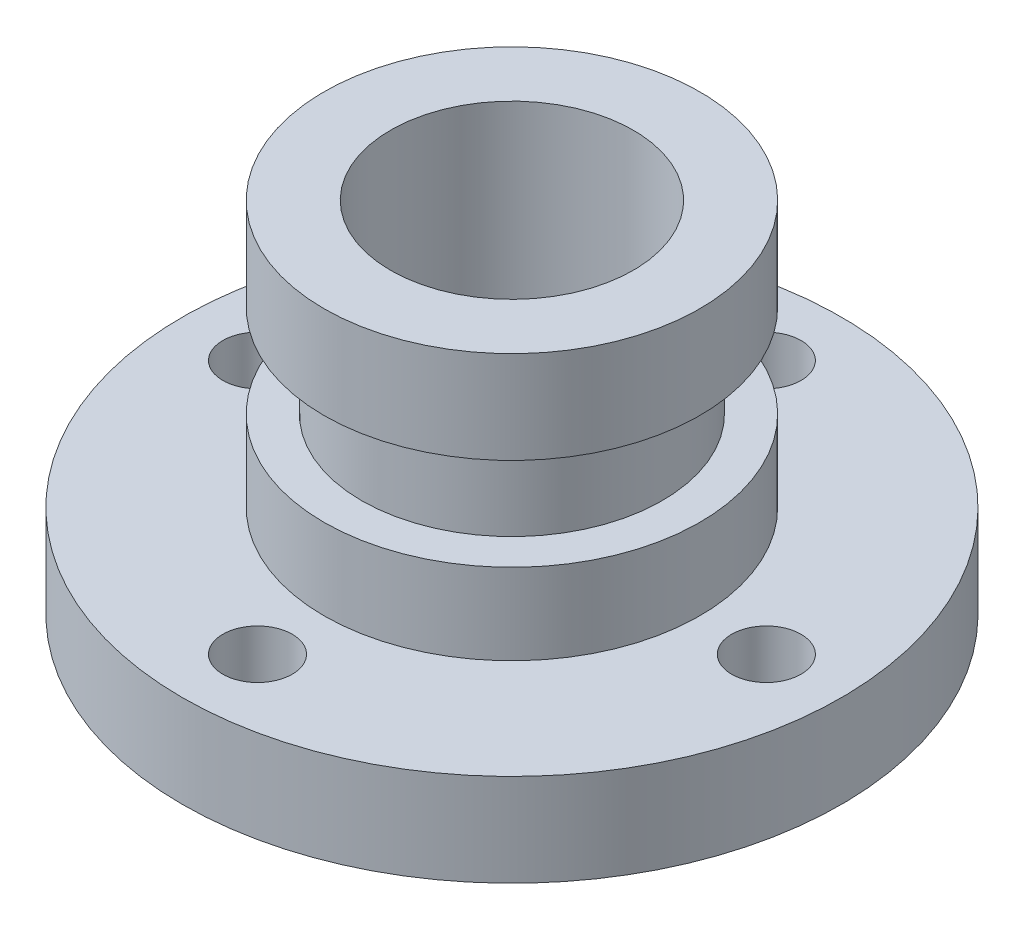
ISO-10303-21;
HEADER;
FILE_DESCRIPTION(('STEP AP214'),'2;1');
FILE_NAME('part.step','',(''),(''),'','','');
FILE_SCHEMA(('AUTOMOTIVE_DESIGN { 1 0 10303 214 1 1 1 1 }'));
ENDSEC;
DATA;
#1=APPLICATION_CONTEXT('core data for automotive mechanical design processes');
#2=APPLICATION_PROTOCOL_DEFINITION('international standard','automotive_design',2000,#1);
#3=PRODUCT_CONTEXT('',#1,'mechanical');
#4=PRODUCT('Part','Part','',(#3));
#5=PRODUCT_RELATED_PRODUCT_CATEGORY('part','',(#4));
#6=PRODUCT_DEFINITION_FORMATION('','',#4);
#7=PRODUCT_DEFINITION_CONTEXT('part definition',#1,'design');
#8=PRODUCT_DEFINITION('design','',#6,#7);
#9=PRODUCT_DEFINITION_SHAPE('','',#8);
#10=(LENGTH_UNIT() NAMED_UNIT(*) SI_UNIT(.MILLI.,.METRE.));
#11=(NAMED_UNIT(*) PLANE_ANGLE_UNIT() SI_UNIT($,.RADIAN.));
#12=(NAMED_UNIT(*) SI_UNIT($,.STERADIAN.) SOLID_ANGLE_UNIT());
#13=UNCERTAINTY_MEASURE_WITH_UNIT(LENGTH_MEASURE(1.E-05),#10,'distance_accuracy_value','');
#14=(GEOMETRIC_REPRESENTATION_CONTEXT(3) GLOBAL_UNCERTAINTY_ASSIGNED_CONTEXT((#13)) GLOBAL_UNIT_ASSIGNED_CONTEXT((#10,
#11,#12)) REPRESENTATION_CONTEXT('',''));
#15=CARTESIAN_POINT('',(0.,0.,0.));
#16=DIRECTION('',(0.,0.,1.));
#17=DIRECTION('',(1.,0.,0.));
#18=AXIS2_PLACEMENT_3D('',#15,#16,#17);
#19=CARTESIAN_POINT('',(0.,81.32,0.));
#20=DIRECTION('',(0.,1.,0.));
#21=DIRECTION('',(0.,0.,1.));
#22=AXIS2_PLACEMENT_3D('',#19,#20,#21);
#23=CYLINDRICAL_SURFACE('',#22,26.);
#24=CARTESIAN_POINT('',(0.,46.,0.));
#25=DIRECTION('',(0.,1.,0.));
#26=DIRECTION('',(0.,0.,1.));
#27=AXIS2_PLACEMENT_3D('',#24,#25,#26);
#28=CIRCLE('',#27,26.);
#29=CARTESIAN_POINT('',(0.,46.,26.));
#30=VERTEX_POINT('',#29);
#31=EDGE_CURVE('E72',#30,#30,#28,.T.);
#32=ORIENTED_EDGE('',*,*,#31,.F.);
#33=EDGE_LOOP('',(#32));
#34=FACE_BOUND('',#33,.T.);
#35=CARTESIAN_POINT('',(0.,30.,0.));
#36=DIRECTION('',(0.,1.,0.));
#37=DIRECTION('',(0.,0.,1.));
#38=AXIS2_PLACEMENT_3D('',#35,#36,#37);
#39=CIRCLE('',#38,26.);
#40=CARTESIAN_POINT('',(0.,30.,26.));
#41=VERTEX_POINT('',#40);
#42=EDGE_CURVE('E10',#41,#41,#39,.T.);
#43=ORIENTED_EDGE('',*,*,#42,.T.);
#44=EDGE_LOOP('',(#43));
#45=FACE_BOUND('',#44,.T.);
#46=ADVANCED_FACE('F37',(#34,#45),#23,.T.);
#47=CARTESIAN_POINT('',(32.5,30.,0.));
#48=DIRECTION('',(0.,-1.,0.));
#49=DIRECTION('',(0.,0.,-1.));
#50=AXIS2_PLACEMENT_3D('',#47,#48,#49);
#51=PLANE('',#50);
#52=ORIENTED_EDGE('',*,*,#42,.F.);
#53=EDGE_LOOP('',(#52));
#54=FACE_BOUND('',#53,.T.);
#55=CARTESIAN_POINT('',(0.,30.,0.));
#56=DIRECTION('',(0.,1.,0.));
#57=DIRECTION('',(0.,0.,1.));
#58=AXIS2_PLACEMENT_3D('',#55,#56,#57);
#59=CIRCLE('',#58,32.5);
#60=CARTESIAN_POINT('',(0.,30.,32.5));
#61=VERTEX_POINT('',#60);
#62=EDGE_CURVE('E44',#61,#61,#59,.T.);
#63=ORIENTED_EDGE('',*,*,#62,.T.);
#64=EDGE_LOOP('',(#63));
#65=FACE_BOUND('',#64,.T.);
#66=ADVANCED_FACE('F166',(#54,#65),#51,.F.);
#67=CARTESIAN_POINT('',(0.,81.32,0.));
#68=DIRECTION('',(0.,1.,0.));
#69=DIRECTION('',(0.,0.,1.));
#70=AXIS2_PLACEMENT_3D('',#67,#68,#69);
#71=CYLINDRICAL_SURFACE('',#70,32.5);
#72=ORIENTED_EDGE('',*,*,#62,.F.);
#73=EDGE_LOOP('',(#72));
#74=FACE_BOUND('',#73,.T.);
#75=CARTESIAN_POINT('',(0.,16.,0.));
#76=DIRECTION('',(0.,1.,0.));
#77=DIRECTION('',(0.,0.,1.));
#78=AXIS2_PLACEMENT_3D('',#75,#76,#77);
#79=CIRCLE('',#78,32.5);
#80=CARTESIAN_POINT('',(0.,16.,32.5));
#81=VERTEX_POINT('',#80);
#82=EDGE_CURVE('E49',#81,#81,#79,.T.);
#83=ORIENTED_EDGE('',*,*,#82,.T.);
#84=EDGE_LOOP('',(#83));
#85=FACE_BOUND('',#84,.T.);
#86=ADVANCED_FACE('F139',(#74,#85),#71,.T.);
#87=CARTESIAN_POINT('',(57.,16.,0.));
#88=DIRECTION('',(0.,-1.,0.));
#89=DIRECTION('',(0.,0.,-1.));
#90=AXIS2_PLACEMENT_3D('',#87,#88,#89);
#91=PLANE('',#90);
#92=CARTESIAN_POINT('',(-44.,16.,1.53625178909098E-13));
#93=DIRECTION('',(0.,-1.,0.));
#94=DIRECTION('',(0.,0.,-1.));
#95=AXIS2_PLACEMENT_3D('',#92,#93,#94);
#96=CIRCLE('',#95,6.);
#97=CARTESIAN_POINT('',(-44.,16.,-5.99999999999985));
#98=VERTEX_POINT('',#97);
#99=EDGE_CURVE('E100',#98,#98,#96,.F.);
#100=ORIENTED_EDGE('',*,*,#99,.F.);
#101=EDGE_LOOP('',(#100));
#102=FACE_BOUND('',#101,.T.);
#103=CARTESIAN_POINT('',(0.,16.,44.));
#104=DIRECTION('',(0.,-1.,0.));
#105=DIRECTION('',(0.,0.,-1.));
#106=AXIS2_PLACEMENT_3D('',#103,#104,#105);
#107=CIRCLE('',#106,6.);
#108=CARTESIAN_POINT('',(0.,16.,38.));
#109=VERTEX_POINT('',#108);
#110=EDGE_CURVE('E104',#109,#109,#107,.F.);
#111=ORIENTED_EDGE('',*,*,#110,.F.);
#112=EDGE_LOOP('',(#111));
#113=FACE_BOUND('',#112,.T.);
#114=CARTESIAN_POINT('',(44.,16.,-4.60875536727294E-13));
#115=DIRECTION('',(0.,-1.,0.));
#116=DIRECTION('',(0.,0.,-1.));
#117=AXIS2_PLACEMENT_3D('',#114,#115,#116);
#118=CIRCLE('',#117,6.);
#119=CARTESIAN_POINT('',(44.,16.,-6.00000000000046));
#120=VERTEX_POINT('',#119);
#121=EDGE_CURVE('E108',#120,#120,#118,.F.);
#122=ORIENTED_EDGE('',*,*,#121,.F.);
#123=EDGE_LOOP('',(#122));
#124=FACE_BOUND('',#123,.T.);
#125=CARTESIAN_POINT('',(0.,16.,-44.));
#126=DIRECTION('',(0.,-1.,0.));
#127=DIRECTION('',(0.,0.,-1.));
#128=AXIS2_PLACEMENT_3D('',#125,#126,#127);
#129=CIRCLE('',#128,6.);
#130=CARTESIAN_POINT('',(0.,16.,-50.));
#131=VERTEX_POINT('',#130);
#132=EDGE_CURVE('E92',#131,#131,#129,.F.);
#133=ORIENTED_EDGE('',*,*,#132,.F.);
#134=EDGE_LOOP('',(#133));
#135=FACE_BOUND('',#134,.T.);
#136=ORIENTED_EDGE('',*,*,#82,.F.);
#137=EDGE_LOOP('',(#136));
#138=FACE_BOUND('',#137,.T.);
#139=CARTESIAN_POINT('',(0.,16.,0.));
#140=DIRECTION('',(0.,1.,0.));
#141=DIRECTION('',(0.,0.,1.));
#142=AXIS2_PLACEMENT_3D('',#139,#140,#141);
#143=CIRCLE('',#142,57.);
#144=CARTESIAN_POINT('',(0.,16.,57.));
#145=VERTEX_POINT('',#144);
#146=EDGE_CURVE('E54',#145,#145,#143,.T.);
#147=ORIENTED_EDGE('',*,*,#146,.T.);
#148=EDGE_LOOP('',(#147));
#149=FACE_BOUND('',#148,.T.);
#150=ADVANCED_FACE('F135',(#102,#113,#124,#135,#138,#149),#91,.F.);
#151=CARTESIAN_POINT('',(0.,81.32,0.));
#152=DIRECTION('',(0.,1.,0.));
#153=DIRECTION('',(0.,0.,1.));
#154=AXIS2_PLACEMENT_3D('',#151,#152,#153);
#155=CYLINDRICAL_SURFACE('',#154,57.);
#156=ORIENTED_EDGE('',*,*,#146,.F.);
#157=EDGE_LOOP('',(#156));
#158=FACE_BOUND('',#157,.T.);
#159=CARTESIAN_POINT('',(0.,0.,0.));
#160=DIRECTION('',(0.,1.,0.));
#161=DIRECTION('',(0.,0.,1.));
#162=AXIS2_PLACEMENT_3D('',#159,#160,#161);
#163=CIRCLE('',#162,57.);
#164=CARTESIAN_POINT('',(0.,0.,57.));
#165=VERTEX_POINT('',#164);
#166=EDGE_CURVE('E60',#165,#165,#163,.T.);
#167=ORIENTED_EDGE('',*,*,#166,.T.);
#168=EDGE_LOOP('',(#167));
#169=FACE_BOUND('',#168,.T.);
#170=ADVANCED_FACE('F138',(#158,#169),#155,.T.);
#171=CARTESIAN_POINT('',(0.,0.,0.));
#172=DIRECTION('',(0.,1.,0.));
#173=DIRECTION('',(0.,0.,1.));
#174=AXIS2_PLACEMENT_3D('',#171,#172,#173);
#175=PLANE('',#174);
#176=CARTESIAN_POINT('',(-44.,0.,1.53625178909098E-13));
#177=DIRECTION('',(0.,1.,0.));
#178=DIRECTION('',(1.,0.,0.));
#179=AXIS2_PLACEMENT_3D('',#176,#177,#178);
#180=CIRCLE('',#179,6.);
#181=CARTESIAN_POINT('',(-38.,0.,1.32676290876039E-13));
#182=VERTEX_POINT('',#181);
#183=EDGE_CURVE('E112',#182,#182,#180,.T.);
#184=ORIENTED_EDGE('',*,*,#183,.T.);
#185=EDGE_LOOP('',(#184));
#186=FACE_BOUND('',#185,.T.);
#187=CARTESIAN_POINT('',(0.,0.,44.));
#188=DIRECTION('',(0.,1.,0.));
#189=DIRECTION('',(0.,0.,-1.));
#190=AXIS2_PLACEMENT_3D('',#187,#188,#189);
#191=CIRCLE('',#190,6.);
#192=CARTESIAN_POINT('',(0.,0.,38.));
#193=VERTEX_POINT('',#192);
#194=EDGE_CURVE('E117',#193,#193,#191,.T.);
#195=ORIENTED_EDGE('',*,*,#194,.T.);
#196=EDGE_LOOP('',(#195));
#197=FACE_BOUND('',#196,.T.);
#198=CARTESIAN_POINT('',(44.,0.,-4.60875536727294E-13));
#199=DIRECTION('',(0.,1.,0.));
#200=DIRECTION('',(-1.,0.,0.));
#201=AXIS2_PLACEMENT_3D('',#198,#199,#200);
#202=CIRCLE('',#201,6.);
#203=CARTESIAN_POINT('',(38.,0.,-3.98028872628117E-13));
#204=VERTEX_POINT('',#203);
#205=EDGE_CURVE('E113',#204,#204,#202,.T.);
#206=ORIENTED_EDGE('',*,*,#205,.T.);
#207=EDGE_LOOP('',(#206));
#208=FACE_BOUND('',#207,.T.);
#209=CARTESIAN_POINT('',(0.,0.,-44.));
#210=DIRECTION('',(0.,1.,0.));
#211=DIRECTION('',(0.,0.,1.));
#212=AXIS2_PLACEMENT_3D('',#209,#210,#211);
#213=CIRCLE('',#212,6.);
#214=CARTESIAN_POINT('',(0.,0.,-38.));
#215=VERTEX_POINT('',#214);
#216=EDGE_CURVE('E96',#215,#215,#213,.T.);
#217=ORIENTED_EDGE('',*,*,#216,.T.);
#218=EDGE_LOOP('',(#217));
#219=FACE_BOUND('',#218,.T.);
#220=CARTESIAN_POINT('',(0.,0.,0.));
#221=DIRECTION('',(0.,1.,0.));
#222=DIRECTION('',(0.,0.,1.));
#223=AXIS2_PLACEMENT_3D('',#220,#221,#222);
#224=CIRCLE('',#223,15.);
#225=CARTESIAN_POINT('',(0.,0.,15.));
#226=VERTEX_POINT('',#225);
#227=EDGE_CURVE('E76',#226,#226,#224,.T.);
#228=ORIENTED_EDGE('',*,*,#227,.T.);
#229=EDGE_LOOP('',(#228));
#230=FACE_BOUND('',#229,.T.);
#231=ORIENTED_EDGE('',*,*,#166,.F.);
#232=EDGE_LOOP('',(#231));
#233=FACE_BOUND('',#232,.T.);
#234=ADVANCED_FACE('F125',(#186,#197,#208,#219,#230,#233),#175,.F.);
#235=CARTESIAN_POINT('',(32.5,62.,0.));
#236=DIRECTION('',(0.,-1.,0.));
#237=DIRECTION('',(0.,0.,-1.));
#238=AXIS2_PLACEMENT_3D('',#235,#236,#237);
#239=PLANE('',#238);
#240=CARTESIAN_POINT('',(0.,62.,0.));
#241=DIRECTION('',(0.,1.,0.));
#242=DIRECTION('',(0.,0.,1.));
#243=AXIS2_PLACEMENT_3D('',#240,#241,#242);
#244=CIRCLE('',#243,21.);
#245=CARTESIAN_POINT('',(0.,62.,21.));
#246=VERTEX_POINT('',#245);
#247=EDGE_CURVE('E88',#246,#246,#244,.T.);
#248=ORIENTED_EDGE('',*,*,#247,.F.);
#249=EDGE_LOOP('',(#248));
#250=FACE_BOUND('',#249,.T.);
#251=CARTESIAN_POINT('',(0.,62.,0.));
#252=DIRECTION('',(0.,1.,0.));
#253=DIRECTION('',(0.,0.,1.));
#254=AXIS2_PLACEMENT_3D('',#251,#252,#253);
#255=CIRCLE('',#254,32.5);
#256=CARTESIAN_POINT('',(0.,62.,32.5));
#257=VERTEX_POINT('',#256);
#258=EDGE_CURVE('E64',#257,#257,#255,.T.);
#259=ORIENTED_EDGE('',*,*,#258,.T.);
#260=EDGE_LOOP('',(#259));
#261=FACE_BOUND('',#260,.T.);
#262=ADVANCED_FACE('F157',(#250,#261),#239,.F.);
#263=CARTESIAN_POINT('',(0.,81.32,0.));
#264=DIRECTION('',(0.,1.,0.));
#265=DIRECTION('',(0.,0.,1.));
#266=AXIS2_PLACEMENT_3D('',#263,#264,#265);
#267=CYLINDRICAL_SURFACE('',#266,32.5);
#268=ORIENTED_EDGE('',*,*,#258,.F.);
#269=EDGE_LOOP('',(#268));
#270=FACE_BOUND('',#269,.T.);
#271=CARTESIAN_POINT('',(0.,46.,0.));
#272=DIRECTION('',(0.,1.,0.));
#273=DIRECTION('',(0.,0.,1.));
#274=AXIS2_PLACEMENT_3D('',#271,#272,#273);
#275=CIRCLE('',#274,32.5);
#276=CARTESIAN_POINT('',(0.,46.,32.5));
#277=VERTEX_POINT('',#276);
#278=EDGE_CURVE('E68',#277,#277,#275,.T.);
#279=ORIENTED_EDGE('',*,*,#278,.T.);
#280=EDGE_LOOP('',(#279));
#281=FACE_BOUND('',#280,.T.);
#282=ADVANCED_FACE('F162',(#270,#281),#267,.T.);
#283=CARTESIAN_POINT('',(26.,46.,0.));
#284=DIRECTION('',(0.,1.,0.));
#285=DIRECTION('',(0.,0.,1.));
#286=AXIS2_PLACEMENT_3D('',#283,#284,#285);
#287=PLANE('',#286);
#288=ORIENTED_EDGE('',*,*,#278,.F.);
#289=EDGE_LOOP('',(#288));
#290=FACE_BOUND('',#289,.T.);
#291=ORIENTED_EDGE('',*,*,#31,.T.);
#292=EDGE_LOOP('',(#291));
#293=FACE_BOUND('',#292,.T.);
#294=ADVANCED_FACE('F174',(#290,#293),#287,.F.);
#295=CARTESIAN_POINT('',(0.,62.,0.));
#296=DIRECTION('',(0.,1.,0.));
#297=DIRECTION('',(0.,0.,1.));
#298=AXIS2_PLACEMENT_3D('',#295,#296,#297);
#299=CYLINDRICAL_SURFACE('',#298,15.);
#300=CARTESIAN_POINT('',(0.,21.,0.));
#301=DIRECTION('',(0.,1.,0.));
#302=DIRECTION('',(0.,0.,1.));
#303=AXIS2_PLACEMENT_3D('',#300,#301,#302);
#304=CIRCLE('',#303,15.);
#305=CARTESIAN_POINT('',(0.,21.,15.));
#306=VERTEX_POINT('',#305);
#307=EDGE_CURVE('E80',#306,#306,#304,.T.);
#308=ORIENTED_EDGE('',*,*,#307,.T.);
#309=EDGE_LOOP('',(#308));
#310=FACE_BOUND('',#309,.T.);
#311=ORIENTED_EDGE('',*,*,#227,.F.);
#312=EDGE_LOOP('',(#311));
#313=FACE_BOUND('',#312,.T.);
#314=ADVANCED_FACE('F176',(#310,#313),#299,.F.);
#315=CARTESIAN_POINT('',(0.,21.,0.));
#316=DIRECTION('',(0.,1.,0.));
#317=DIRECTION('',(0.,0.,1.));
#318=AXIS2_PLACEMENT_3D('',#315,#316,#317);
#319=CONICAL_SURFACE('',#318,15.,0.785398163397448);
#320=CARTESIAN_POINT('',(0.,27.,0.));
#321=DIRECTION('',(0.,1.,0.));
#322=DIRECTION('',(0.,0.,1.));
#323=AXIS2_PLACEMENT_3D('',#320,#321,#322);
#324=CIRCLE('',#323,21.);
#325=CARTESIAN_POINT('',(0.,27.,21.));
#326=VERTEX_POINT('',#325);
#327=EDGE_CURVE('E84',#326,#326,#324,.T.);
#328=ORIENTED_EDGE('',*,*,#327,.T.);
#329=EDGE_LOOP('',(#328));
#330=FACE_BOUND('',#329,.T.);
#331=ORIENTED_EDGE('',*,*,#307,.F.);
#332=EDGE_LOOP('',(#331));
#333=FACE_BOUND('',#332,.T.);
#334=ADVANCED_FACE('F183',(#330,#333),#319,.F.);
#335=CARTESIAN_POINT('',(0.,62.,0.));
#336=DIRECTION('',(0.,1.,0.));
#337=DIRECTION('',(0.,0.,1.));
#338=AXIS2_PLACEMENT_3D('',#335,#336,#337);
#339=CYLINDRICAL_SURFACE('',#338,21.);
#340=ORIENTED_EDGE('',*,*,#247,.T.);
#341=EDGE_LOOP('',(#340));
#342=FACE_BOUND('',#341,.T.);
#343=ORIENTED_EDGE('',*,*,#327,.F.);
#344=EDGE_LOOP('',(#343));
#345=FACE_BOUND('',#344,.T.);
#346=ADVANCED_FACE('F192',(#342,#345),#339,.F.);
#347=CARTESIAN_POINT('',(0.,62.,-44.));
#348=DIRECTION('',(0.,-1.,0.));
#349=DIRECTION('',(0.,0.,-1.));
#350=AXIS2_PLACEMENT_3D('',#347,#348,#349);
#351=CYLINDRICAL_SURFACE('',#350,6.);
#352=ORIENTED_EDGE('',*,*,#216,.F.);
#353=EDGE_LOOP('',(#352));
#354=FACE_BOUND('',#353,.T.);
#355=ORIENTED_EDGE('',*,*,#132,.T.);
#356=EDGE_LOOP('',(#355));
#357=FACE_BOUND('',#356,.T.);
#358=ADVANCED_FACE('F196',(#354,#357),#351,.F.);
#359=CARTESIAN_POINT('',(44.,62.,-4.60875536727294E-13));
#360=DIRECTION('',(0.,-1.,0.));
#361=DIRECTION('',(0.,0.,-1.));
#362=AXIS2_PLACEMENT_3D('',#359,#360,#361);
#363=CYLINDRICAL_SURFACE('',#362,6.);
#364=ORIENTED_EDGE('',*,*,#205,.F.);
#365=EDGE_LOOP('',(#364));
#366=FACE_BOUND('',#365,.T.);
#367=ORIENTED_EDGE('',*,*,#121,.T.);
#368=EDGE_LOOP('',(#367));
#369=FACE_BOUND('',#368,.T.);
#370=ADVANCED_FACE('F200',(#366,#369),#363,.F.);
#371=CARTESIAN_POINT('',(0.,62.,44.));
#372=DIRECTION('',(0.,-1.,0.));
#373=DIRECTION('',(0.,0.,-1.));
#374=AXIS2_PLACEMENT_3D('',#371,#372,#373);
#375=CYLINDRICAL_SURFACE('',#374,6.);
#376=ORIENTED_EDGE('',*,*,#194,.F.);
#377=EDGE_LOOP('',(#376));
#378=FACE_BOUND('',#377,.T.);
#379=ORIENTED_EDGE('',*,*,#110,.T.);
#380=EDGE_LOOP('',(#379));
#381=FACE_BOUND('',#380,.T.);
#382=ADVANCED_FACE('F131',(#378,#381),#375,.F.);
#383=CARTESIAN_POINT('',(-44.,62.,1.53625178909098E-13));
#384=DIRECTION('',(0.,-1.,0.));
#385=DIRECTION('',(0.,0.,-1.));
#386=AXIS2_PLACEMENT_3D('',#383,#384,#385);
#387=CYLINDRICAL_SURFACE('',#386,6.);
#388=ORIENTED_EDGE('',*,*,#183,.F.);
#389=EDGE_LOOP('',(#388));
#390=FACE_BOUND('',#389,.T.);
#391=ORIENTED_EDGE('',*,*,#99,.T.);
#392=EDGE_LOOP('',(#391));
#393=FACE_BOUND('',#392,.T.);
#394=ADVANCED_FACE('F128',(#390,#393),#387,.F.);
#395=CLOSED_SHELL('',(#46,#66,#86,#150,#170,#234,#262,#282,#294,#314,#334,#346,#358,#370,#382,#394));
#396=MANIFOLD_SOLID_BREP('B2',#395);
#397=ADVANCED_BREP_SHAPE_REPRESENTATION('',(#18,#396),#14);
#398=SHAPE_DEFINITION_REPRESENTATION(#9,#397);
ENDSEC;
END-ISO-10303-21;
